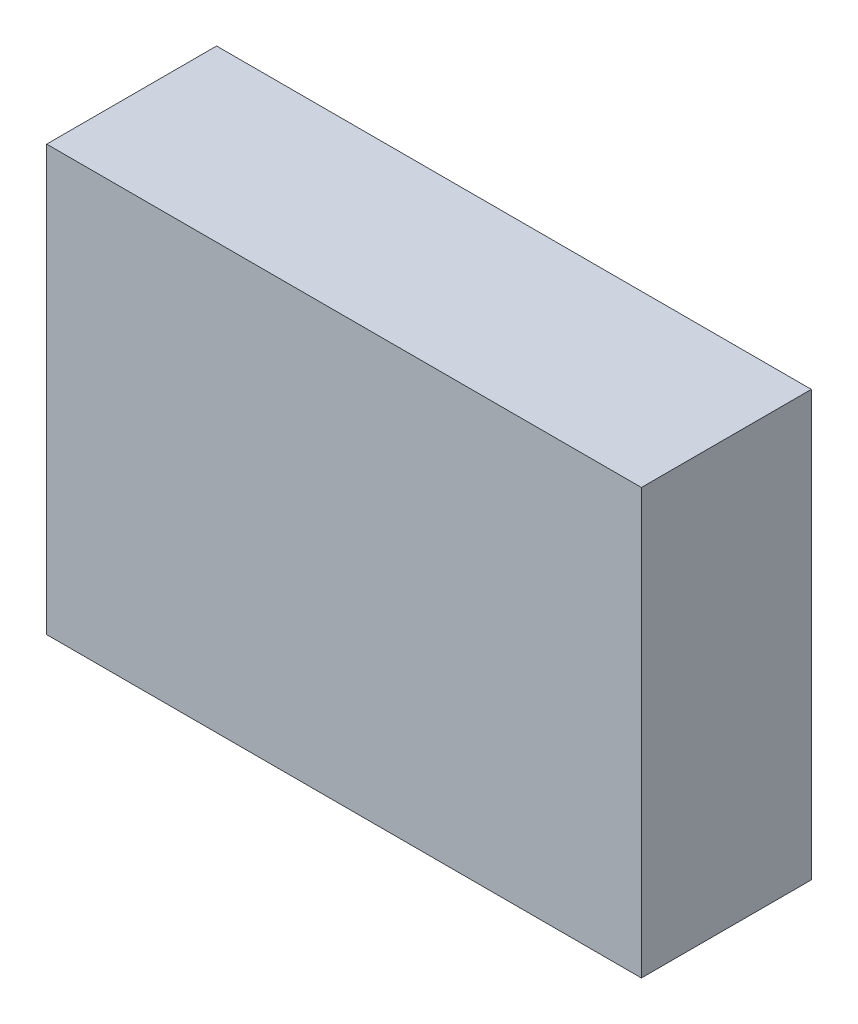
ISO-10303-21;
HEADER;
FILE_DESCRIPTION(('STEP AP214'),'2;1');
FILE_NAME('part.step','',(''),(''),'','','');
FILE_SCHEMA(('AUTOMOTIVE_DESIGN { 1 0 10303 214 1 1 1 1 }'));
ENDSEC;
DATA;
#1=APPLICATION_CONTEXT('core data for automotive mechanical design processes');
#2=APPLICATION_PROTOCOL_DEFINITION('international standard','automotive_design',2000,#1);
#3=PRODUCT_CONTEXT('',#1,'mechanical');
#4=PRODUCT('Part','Part','',(#3));
#5=PRODUCT_RELATED_PRODUCT_CATEGORY('part','',(#4));
#6=PRODUCT_DEFINITION_FORMATION('','',#4);
#7=PRODUCT_DEFINITION_CONTEXT('part definition',#1,'design');
#8=PRODUCT_DEFINITION('design','',#6,#7);
#9=PRODUCT_DEFINITION_SHAPE('','',#8);
#10=(LENGTH_UNIT() NAMED_UNIT(*) SI_UNIT(.MILLI.,.METRE.));
#11=(NAMED_UNIT(*) PLANE_ANGLE_UNIT() SI_UNIT($,.RADIAN.));
#12=(NAMED_UNIT(*) SI_UNIT($,.STERADIAN.) SOLID_ANGLE_UNIT());
#13=UNCERTAINTY_MEASURE_WITH_UNIT(LENGTH_MEASURE(1.E-05),#10,'distance_accuracy_value','');
#14=(GEOMETRIC_REPRESENTATION_CONTEXT(3) GLOBAL_UNCERTAINTY_ASSIGNED_CONTEXT((#13)) GLOBAL_UNIT_ASSIGNED_CONTEXT((#10,
#11,#12)) REPRESENTATION_CONTEXT('',''));
#15=CARTESIAN_POINT('',(0.,0.,0.));
#16=DIRECTION('',(0.,0.,1.));
#17=DIRECTION('',(1.,0.,0.));
#18=AXIS2_PLACEMENT_3D('',#15,#16,#17);
#19=CARTESIAN_POINT('',(-3.5,-2.5,0.));
#20=DIRECTION('',(0.,1.,0.));
#21=DIRECTION('',(1.,0.,0.));
#22=AXIS2_PLACEMENT_3D('',#19,#20,#21);
#23=PLANE('',#22);
#24=DIRECTION('',(1.,0.,0.));
#25=VECTOR('',#24,1.);
#26=CARTESIAN_POINT('',(-3.5,-2.5,0.));
#27=LINE('',#26,#25);
#28=CARTESIAN_POINT('',(-3.5,-2.5,0.));
#29=VERTEX_POINT('',#28);
#30=CARTESIAN_POINT('',(3.5,-2.5,0.));
#31=VERTEX_POINT('',#30);
#32=EDGE_CURVE('E11',#29,#31,#27,.T.);
#33=ORIENTED_EDGE('',*,*,#32,.T.);
#34=DIRECTION('',(0.,0.,1.));
#35=VECTOR('',#34,1.);
#36=CARTESIAN_POINT('',(3.5,-2.5,0.));
#37=LINE('',#36,#35);
#38=CARTESIAN_POINT('',(3.5,-2.5,2.));
#39=VERTEX_POINT('',#38);
#40=EDGE_CURVE('E24',#31,#39,#37,.T.);
#41=ORIENTED_EDGE('',*,*,#40,.T.);
#42=DIRECTION('',(1.,0.,0.));
#43=VECTOR('',#42,1.);
#44=CARTESIAN_POINT('',(-3.5,-2.5,2.));
#45=LINE('',#44,#43);
#46=CARTESIAN_POINT('',(-3.5,-2.5,2.));
#47=VERTEX_POINT('',#46);
#48=EDGE_CURVE('E87',#47,#39,#45,.T.);
#49=ORIENTED_EDGE('',*,*,#48,.F.);
#50=DIRECTION('',(0.,0.,1.));
#51=VECTOR('',#50,1.);
#52=CARTESIAN_POINT('',(-3.5,-2.5,0.));
#53=LINE('',#52,#51);
#54=EDGE_CURVE('E36',#29,#47,#53,.T.);
#55=ORIENTED_EDGE('',*,*,#54,.F.);
#56=EDGE_LOOP('',(#33,#41,#49,#55));
#57=FACE_BOUND('',#56,.T.);
#58=ADVANCED_FACE('F17',(#57),#23,.F.);
#59=CARTESIAN_POINT('',(3.5,-2.5,0.));
#60=DIRECTION('',(-1.,0.,0.));
#61=DIRECTION('',(0.,1.,0.));
#62=AXIS2_PLACEMENT_3D('',#59,#60,#61);
#63=PLANE('',#62);
#64=DIRECTION('',(0.,1.,0.));
#65=VECTOR('',#64,1.);
#66=CARTESIAN_POINT('',(3.5,-2.5,0.));
#67=LINE('',#66,#65);
#68=CARTESIAN_POINT('',(3.5,2.5,0.));
#69=VERTEX_POINT('',#68);
#70=EDGE_CURVE('E84',#31,#69,#67,.T.);
#71=ORIENTED_EDGE('',*,*,#70,.T.);
#72=DIRECTION('',(0.,0.,1.));
#73=VECTOR('',#72,1.);
#74=CARTESIAN_POINT('',(3.5,2.5,0.));
#75=LINE('',#74,#73);
#76=CARTESIAN_POINT('',(3.5,2.5,2.));
#77=VERTEX_POINT('',#76);
#78=EDGE_CURVE('E82',#69,#77,#75,.T.);
#79=ORIENTED_EDGE('',*,*,#78,.T.);
#80=DIRECTION('',(0.,1.,0.));
#81=VECTOR('',#80,1.);
#82=CARTESIAN_POINT('',(3.5,-2.5,2.));
#83=LINE('',#82,#81);
#84=EDGE_CURVE('E62',#39,#77,#83,.T.);
#85=ORIENTED_EDGE('',*,*,#84,.F.);
#86=ORIENTED_EDGE('',*,*,#40,.F.);
#87=EDGE_LOOP('',(#71,#79,#85,#86));
#88=FACE_BOUND('',#87,.T.);
#89=ADVANCED_FACE('F89',(#88),#63,.F.);
#90=CARTESIAN_POINT('',(3.5,2.5,0.));
#91=DIRECTION('',(0.,-1.,0.));
#92=DIRECTION('',(-1.,0.,0.));
#93=AXIS2_PLACEMENT_3D('',#90,#91,#92);
#94=PLANE('',#93);
#95=DIRECTION('',(-1.,0.,0.));
#96=VECTOR('',#95,1.);
#97=CARTESIAN_POINT('',(3.5,2.5,0.));
#98=LINE('',#97,#96);
#99=CARTESIAN_POINT('',(-3.5,2.5,0.));
#100=VERTEX_POINT('',#99);
#101=EDGE_CURVE('E71',#69,#100,#98,.T.);
#102=ORIENTED_EDGE('',*,*,#101,.T.);
#103=DIRECTION('',(0.,0.,1.));
#104=VECTOR('',#103,1.);
#105=CARTESIAN_POINT('',(-3.5,2.5,0.));
#106=LINE('',#105,#104);
#107=CARTESIAN_POINT('',(-3.5,2.5,2.));
#108=VERTEX_POINT('',#107);
#109=EDGE_CURVE('E65',#100,#108,#106,.T.);
#110=ORIENTED_EDGE('',*,*,#109,.T.);
#111=DIRECTION('',(-1.,0.,0.));
#112=VECTOR('',#111,1.);
#113=CARTESIAN_POINT('',(3.5,2.5,2.));
#114=LINE('',#113,#112);
#115=EDGE_CURVE('E57',#77,#108,#114,.T.);
#116=ORIENTED_EDGE('',*,*,#115,.F.);
#117=ORIENTED_EDGE('',*,*,#78,.F.);
#118=EDGE_LOOP('',(#102,#110,#116,#117));
#119=FACE_BOUND('',#118,.T.);
#120=ADVANCED_FACE('F69',(#119),#94,.F.);
#121=CARTESIAN_POINT('',(-3.5,2.5,0.));
#122=DIRECTION('',(1.,0.,0.));
#123=DIRECTION('',(0.,-1.,0.));
#124=AXIS2_PLACEMENT_3D('',#121,#122,#123);
#125=PLANE('',#124);
#126=DIRECTION('',(0.,-1.,0.));
#127=VECTOR('',#126,1.);
#128=CARTESIAN_POINT('',(-3.5,2.5,0.));
#129=LINE('',#128,#127);
#130=EDGE_CURVE('E66',#100,#29,#129,.T.);
#131=ORIENTED_EDGE('',*,*,#130,.T.);
#132=ORIENTED_EDGE('',*,*,#54,.T.);
#133=DIRECTION('',(0.,-1.,0.));
#134=VECTOR('',#133,1.);
#135=CARTESIAN_POINT('',(-3.5,2.5,2.));
#136=LINE('',#135,#134);
#137=EDGE_CURVE('E61',#108,#47,#136,.T.);
#138=ORIENTED_EDGE('',*,*,#137,.F.);
#139=ORIENTED_EDGE('',*,*,#109,.F.);
#140=EDGE_LOOP('',(#131,#132,#138,#139));
#141=FACE_BOUND('',#140,.T.);
#142=ADVANCED_FACE('F76',(#141),#125,.F.);
#143=CARTESIAN_POINT('',(0.,0.,0.));
#144=DIRECTION('',(0.,0.,1.));
#145=DIRECTION('',(1.,0.,0.));
#146=AXIS2_PLACEMENT_3D('',#143,#144,#145);
#147=PLANE('',#146);
#148=ORIENTED_EDGE('',*,*,#130,.F.);
#149=ORIENTED_EDGE('',*,*,#101,.F.);
#150=ORIENTED_EDGE('',*,*,#70,.F.);
#151=ORIENTED_EDGE('',*,*,#32,.F.);
#152=EDGE_LOOP('',(#148,#149,#150,#151));
#153=FACE_BOUND('',#152,.T.);
#154=ADVANCED_FACE('F91',(#153),#147,.F.);
#155=CARTESIAN_POINT('',(0.,0.,2.));
#156=DIRECTION('',(0.,0.,1.));
#157=DIRECTION('',(1.,0.,0.));
#158=AXIS2_PLACEMENT_3D('',#155,#156,#157);
#159=PLANE('',#158);
#160=ORIENTED_EDGE('',*,*,#48,.T.);
#161=ORIENTED_EDGE('',*,*,#84,.T.);
#162=ORIENTED_EDGE('',*,*,#115,.T.);
#163=ORIENTED_EDGE('',*,*,#137,.T.);
#164=EDGE_LOOP('',(#160,#161,#162,#163));
#165=FACE_BOUND('',#164,.T.);
#166=ADVANCED_FACE('F59',(#165),#159,.T.);
#167=CLOSED_SHELL('',(#58,#89,#120,#142,#154,#166));
#168=MANIFOLD_SOLID_BREP('B1',#167);
#169=ADVANCED_BREP_SHAPE_REPRESENTATION('',(#18,#168),#14);
#170=SHAPE_DEFINITION_REPRESENTATION(#9,#169);
ENDSEC;
END-ISO-10303-21;
